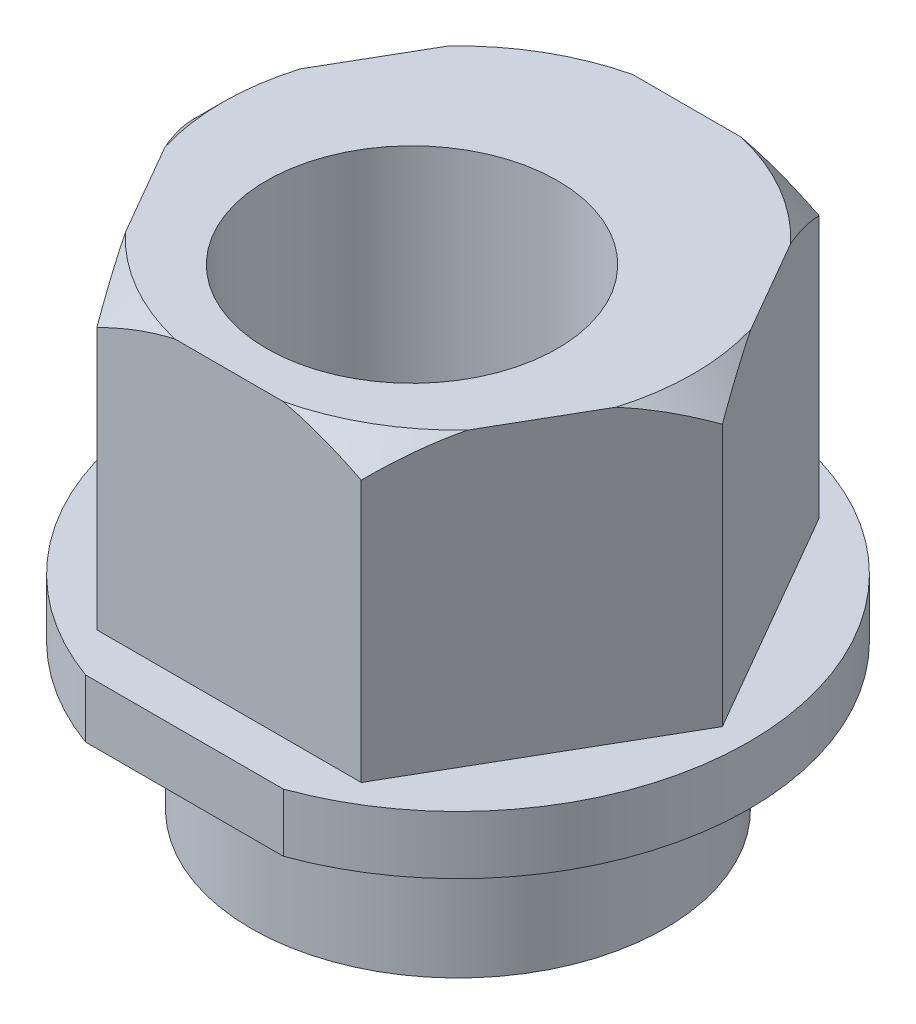
ISO-10303-21;
HEADER;
FILE_DESCRIPTION(('STEP AP214'),'2;1');
FILE_NAME('part.step','',(''),(''),'','','');
FILE_SCHEMA(('AUTOMOTIVE_DESIGN { 1 0 10303 214 1 1 1 1 }'));
ENDSEC;
DATA;
#1=APPLICATION_CONTEXT('core data for automotive mechanical design processes');
#2=APPLICATION_PROTOCOL_DEFINITION('international standard','automotive_design',2000,#1);
#3=PRODUCT_CONTEXT('',#1,'mechanical');
#4=PRODUCT('Part','Part','',(#3));
#5=PRODUCT_RELATED_PRODUCT_CATEGORY('part','',(#4));
#6=PRODUCT_DEFINITION_FORMATION('','',#4);
#7=PRODUCT_DEFINITION_CONTEXT('part definition',#1,'design');
#8=PRODUCT_DEFINITION('design','',#6,#7);
#9=PRODUCT_DEFINITION_SHAPE('','',#8);
#10=(LENGTH_UNIT() NAMED_UNIT(*) SI_UNIT(.MILLI.,.METRE.));
#11=(NAMED_UNIT(*) PLANE_ANGLE_UNIT() SI_UNIT($,.RADIAN.));
#12=(NAMED_UNIT(*) SI_UNIT($,.STERADIAN.) SOLID_ANGLE_UNIT());
#13=UNCERTAINTY_MEASURE_WITH_UNIT(LENGTH_MEASURE(1.E-05),#10,'distance_accuracy_value','');
#14=(GEOMETRIC_REPRESENTATION_CONTEXT(3) GLOBAL_UNCERTAINTY_ASSIGNED_CONTEXT((#13)) GLOBAL_UNIT_ASSIGNED_CONTEXT((#10,
#11,#12)) REPRESENTATION_CONTEXT('',''));
#15=CARTESIAN_POINT('',(0.,0.,0.));
#16=DIRECTION('',(0.,0.,1.));
#17=DIRECTION('',(1.,0.,0.));
#18=AXIS2_PLACEMENT_3D('',#15,#16,#17);
#19=CARTESIAN_POINT('',(0.,-1.,0.));
#20=DIRECTION('',(0.,1.,0.));
#21=DIRECTION('',(0.,0.,1.));
#22=AXIS2_PLACEMENT_3D('',#19,#20,#21);
#23=PLANE('',#22);
#24=CARTESIAN_POINT('',(0.,-1.,0.));
#25=DIRECTION('',(0.,1.,0.));
#26=DIRECTION('',(0.,0.,1.));
#27=AXIS2_PLACEMENT_3D('',#24,#25,#26);
#28=CIRCLE('',#27,5.);
#29=CARTESIAN_POINT('',(1.7,-1.,4.7021271782035));
#30=VERTEX_POINT('',#29);
#31=CARTESIAN_POINT('',(-1.7,-1.,4.7021271782035));
#32=VERTEX_POINT('',#31);
#33=EDGE_CURVE('E221',#30,#32,#28,.T.);
#34=ORIENTED_EDGE('',*,*,#33,.F.);
#35=DIRECTION('',(-1.,0.,0.));
#36=VECTOR('',#35,1.);
#37=CARTESIAN_POINT('',(0.,-1.,4.7021271782035));
#38=LINE('',#37,#36);
#39=EDGE_CURVE('E330',#30,#32,#38,.T.);
#40=ORIENTED_EDGE('',*,*,#39,.T.);
#41=EDGE_LOOP('',(#34,#40));
#42=FACE_BOUND('',#41,.T.);
#43=CARTESIAN_POINT('',(0.,-1.,0.));
#44=DIRECTION('',(0.,1.,0.));
#45=DIRECTION('',(0.,0.,1.));
#46=AXIS2_PLACEMENT_3D('',#43,#44,#45);
#47=CIRCLE('',#46,3.555);
#48=CARTESIAN_POINT('',(0.,-1.,3.555));
#49=VERTEX_POINT('',#48);
#50=EDGE_CURVE('E166',#49,#49,#47,.F.);
#51=ORIENTED_EDGE('',*,*,#50,.F.);
#52=EDGE_LOOP('',(#51));
#53=FACE_BOUND('',#52,.T.);
#54=ADVANCED_FACE('F34',(#42,#53),#23,.F.);
#55=CARTESIAN_POINT('',(2.27187330926118,5.,3.935));
#56=DIRECTION('',(-0.866025403784439,0.,-0.5));
#57=DIRECTION('',(-0.5,0.,0.866025403784439));
#58=AXIS2_PLACEMENT_3D('',#55,#56,#57);
#59=PLANE('',#58);
#60=DIRECTION('',(0.,-1.,0.));
#61=VECTOR('',#60,1.);
#62=CARTESIAN_POINT('',(4.54374661852235,5.,0.));
#63=LINE('',#62,#61);
#64=CARTESIAN_POINT('',(4.54374661852235,4.5,0.));
#65=VERTEX_POINT('',#64);
#66=CARTESIAN_POINT('',(4.54374661852235,0.,0.));
#67=VERTEX_POINT('',#66);
#68=EDGE_CURVE('E163',#65,#67,#63,.T.);
#69=ORIENTED_EDGE('',*,*,#68,.F.);
#70=CARTESIAN_POINT('',(6.12736327266163,2.33046829888115,-2.74290450468147));
#71=CARTESIAN_POINT('',(6.07348339276709,2.4177650828994,-2.64958181519841));
#72=CARTESIAN_POINT('',(6.01938921555573,2.50453762285222,-2.55588795187471));
#73=CARTESIAN_POINT('',(5.91069789973588,2.67683309661582,-2.36762907053321));
#74=CARTESIAN_POINT('',(5.85610071578471,2.76235591593962,-2.27306397397959));
#75=CARTESIAN_POINT('',(5.74620735938589,2.9321379387506,-2.08272309728255));
#76=CARTESIAN_POINT('',(5.6909098259844,3.01639362513631,-1.98694495989795));
#77=CARTESIAN_POINT('',(5.57966030231228,3.18315508159383,-1.79425513258));
#78=CARTESIAN_POINT('',(5.52370832991605,3.26566089928668,-1.69734347360602));
#79=CARTESIAN_POINT('',(5.40948255505868,3.43085092459455,-1.49949862801914));
#80=CARTESIAN_POINT('',(5.3511874452437,3.51347634106705,-1.3985285359868));
#81=CARTESIAN_POINT('',(5.23367321649109,3.67605365317037,-1.194987921175));
#82=CARTESIAN_POINT('',(5.17445413325307,3.75600565172091,-1.09241746022911));
#83=CARTESIAN_POINT('',(5.05499257757878,3.9125743398257,-0.885503976250002));
#84=CARTESIAN_POINT('',(4.99475102957391,3.98919384008597,-0.78116255437897));
#85=CARTESIAN_POINT('',(4.873034492307,4.1383918042904,-0.570343327711337));
#86=CARTESIAN_POINT('',(4.81155966257741,4.21097078637303,-0.463865799233039));
#87=CARTESIAN_POINT('',(4.68581480841085,4.35265115676022,-0.246069323026223));
#88=CARTESIAN_POINT('',(4.62151303943029,4.42164059850529,-0.134695392135335));
#89=CARTESIAN_POINT('',(4.4912183922476,4.55301635986169,0.090981556739347));
#90=CARTESIAN_POINT('',(4.42522527529575,4.61540174079966,0.205284988249787));
#91=CARTESIAN_POINT('',(4.29176890522431,4.73150823576122,0.436438201807242));
#92=CARTESIAN_POINT('',(4.22431561588303,4.78527468558276,0.553270726083977));
#93=CARTESIAN_POINT('',(4.08756303909753,4.88247623364584,0.790133137142428));
#94=CARTESIAN_POINT('',(4.01826431274338,4.92591443311341,0.910162052087628));
#95=CARTESIAN_POINT('',(3.89160680975576,4.99299560676046,1.129539282422));
#96=CARTESIAN_POINT('',(3.83454175212893,5.01884439579798,1.22837886156851));
#97=CARTESIAN_POINT('',(3.71955042243969,5.06126068823275,1.42754968702018));
#98=CARTESIAN_POINT('',(3.66162427680432,5.0778295405829,1.52788071434728));
#99=CARTESIAN_POINT('',(3.54536540774452,5.10083438466152,1.72924698238935));
#100=CARTESIAN_POINT('',(3.4870335640049,5.1072879053957,1.83028069944554));
#101=CARTESIAN_POINT('',(3.37031281221754,5.10976287991731,2.03244697183888));
#102=CARTESIAN_POINT('',(3.31192390350574,5.10578421082689,2.13357952832621));
#103=CARTESIAN_POINT('',(3.19571069696838,5.08764038060559,2.33486670655941));
#104=CARTESIAN_POINT('',(3.13788528988516,5.07350318473267,2.43502324959591));
#105=CARTESIAN_POINT('',(3.02300572590152,5.03579603444199,2.63400049116693));
#106=CARTESIAN_POINT('',(2.96595175572664,5.01222383709666,2.73282086628335));
#107=CARTESIAN_POINT('',(2.85271904802042,4.95661618256865,2.9289456691091));
#108=CARTESIAN_POINT('',(2.79654337792266,4.92455603960202,3.02624478386765));
#109=CARTESIAN_POINT('',(2.68537248742994,4.85318593152667,3.21879841452373));
#110=CARTESIAN_POINT('',(2.63037720983353,4.81387631861451,3.31405302949706));
#111=CARTESIAN_POINT('',(2.5019161833033,4.71383121159169,3.53655405423988));
#112=CARTESIAN_POINT('',(2.42896022795634,4.65048731772351,3.66291747561553));
#113=CARTESIAN_POINT('',(2.28511505424096,4.51496245516658,3.91206462491415));
#114=CARTESIAN_POINT('',(2.2142269607044,4.44277678394606,4.03484640457117));
#115=CARTESIAN_POINT('',(2.07416708594693,4.29140781010891,4.27743722375284));
#116=CARTESIAN_POINT('',(2.00499919286836,4.21221022636325,4.39723952881742));
#117=CARTESIAN_POINT('',(1.86828970424628,4.04847541244671,4.63402730898762));
#118=CARTESIAN_POINT('',(1.80074782327538,3.96393912900212,4.75101327846797));
#119=CARTESIAN_POINT('',(1.6667324101583,3.790255628053,4.9831347829841));
#120=CARTESIAN_POINT('',(1.60026513983173,3.70108917509827,5.09825947223014));
#121=CARTESIAN_POINT('',(1.46849790545969,3.51936003005431,5.32648701693534));
#122=CARTESIAN_POINT('',(1.40319803917282,3.42679705550268,5.43958970307165));
#123=CARTESIAN_POINT('',(1.27366225353528,3.23904020589262,5.66395226519422));
#124=CARTESIAN_POINT('',(1.20942525212282,3.14384930831284,5.77521401536649));
#125=CARTESIAN_POINT('',(1.08179181966025,2.9512386314917,5.99628160513605));
#126=CARTESIAN_POINT('',(1.01839540535985,2.85381880794148,6.10608741572204));
#127=CARTESIAN_POINT('',(0.910409016945997,2.6853578347565,6.2931253269807));
#128=CARTESIAN_POINT('',(0.865642352807006,2.61476846228915,6.3706634637548));
#129=CARTESIAN_POINT('',(0.776622094234247,2.47305833440251,6.52485107450574));
#130=CARTESIAN_POINT('',(0.732367142810404,2.40194099006958,6.60150289885833));
#131=CARTESIAN_POINT('',(0.688256655121896,2.33046829888115,6.67790450468147));
#132=B_SPLINE_CURVE_WITH_KNOTS('',3,(#70,#71,#72,#73,#74,#75,#76,#77,#78,#79,#80,#81,#82,#83,
#84,#85,#86,#87,#88,#89,#90,#91,#92,#93,#94,#95,#96,#97,#98,#99,#100,#101,#102,#103,#104,#105,
#106,#107,#108,#109,#110,#111,#112,#113,#114,#115,#116,#117,#118,#119,#120,#121,#122,#123,#124,
#125,#126,#127,#128,#129,#130,#131),.UNSPECIFIED.,.F.,.F.,(4,2,2,2,2,2,2,2,2,2,2,2,2,2,2,2,2,2,
2,2,2,2,2,2,2,2,2,2,2,2,4),(0.,0.416050988652375,0.832139855784054,1.24922530063749,
1.6662993802975,2.09496685038955,2.52361779884089,2.95189991005181,3.38012697311563,
3.81779500231414,4.25552515650994,4.69087140580247,5.12608676971888,5.4768138337239,
5.82748990199696,6.17755760407587,6.52762942952254,6.87674122143841,7.22593605499141,
7.5761578380004,7.92636261087879,8.40316579002672,8.88022366888807,9.35827656071276,
9.83624491486482,10.316388748245,10.7965726023688,11.2762330860941,11.7559031133002,
12.0979389750605,12.4385584137849),.UNSPECIFIED.);
#133=CARTESIAN_POINT('',(3.87355176865353,5.,1.1608115309438));
#134=VERTEX_POINT('',#133);
#135=EDGE_CURVE('E310',#65,#134,#132,.T.);
#136=ORIENTED_EDGE('',*,*,#135,.T.);
#137=DIRECTION('',(0.5,0.,-0.866025403784439));
#138=VECTOR('',#137,1.);
#139=CARTESIAN_POINT('',(2.27187330926118,5.,3.935));
#140=LINE('',#139,#138);
#141=CARTESIAN_POINT('',(2.94206815913,5.,2.7741884690562));
#142=VERTEX_POINT('',#141);
#143=EDGE_CURVE('E233',#142,#134,#140,.T.);
#144=ORIENTED_EDGE('',*,*,#143,.F.);
#145=CARTESIAN_POINT('',(2.27187330926118,4.5,3.935));
#146=VERTEX_POINT('',#145);
#147=EDGE_CURVE('E250',#142,#146,#132,.T.);
#148=ORIENTED_EDGE('',*,*,#147,.T.);
#149=DIRECTION('',(0.,-1.,0.));
#150=VECTOR('',#149,1.);
#151=CARTESIAN_POINT('',(2.27187330926118,5.,3.935));
#152=LINE('',#151,#150);
#153=CARTESIAN_POINT('',(2.27187330926118,0.,3.935));
#154=VERTEX_POINT('',#153);
#155=EDGE_CURVE('E217',#146,#154,#152,.T.);
#156=ORIENTED_EDGE('',*,*,#155,.T.);
#157=DIRECTION('',(0.5,0.,-0.866025403784439));
#158=VECTOR('',#157,1.);
#159=CARTESIAN_POINT('',(2.27187330926118,0.,3.935));
#160=LINE('',#159,#158);
#161=EDGE_CURVE('E218',#154,#67,#160,.T.);
#162=ORIENTED_EDGE('',*,*,#161,.T.);
#163=EDGE_LOOP('',(#69,#136,#144,#148,#156,#162));
#164=FACE_BOUND('',#163,.T.);
#165=ADVANCED_FACE('F36',(#164),#59,.F.);
#166=CARTESIAN_POINT('',(4.54374661852235,5.,0.));
#167=DIRECTION('',(-0.866025403784438,0.,0.5));
#168=DIRECTION('',(0.5,0.,0.866025403784438));
#169=AXIS2_PLACEMENT_3D('',#166,#167,#168);
#170=PLANE('',#169);
#171=DIRECTION('',(0.,-1.,0.));
#172=VECTOR('',#171,1.);
#173=CARTESIAN_POINT('',(2.27187330926118,5.,-3.935));
#174=LINE('',#173,#172);
#175=CARTESIAN_POINT('',(2.27187330926118,4.5,-3.935));
#176=VERTEX_POINT('',#175);
#177=CARTESIAN_POINT('',(2.27187330926118,0.,-3.935));
#178=VERTEX_POINT('',#177);
#179=EDGE_CURVE('E152',#176,#178,#174,.T.);
#180=ORIENTED_EDGE('',*,*,#179,.F.);
#181=CARTESIAN_POINT('',(0.688256655121894,2.33046829888116,-6.67790450468146));
#182=CARTESIAN_POINT('',(0.742136535016436,2.4177650828994,-6.58458181519841));
#183=CARTESIAN_POINT('',(0.796230712227795,2.50453762285222,-6.4908879518747));
#184=CARTESIAN_POINT('',(0.904922028047648,2.67683309661582,-6.3026290705332));
#185=CARTESIAN_POINT('',(0.959519211998818,2.76235591593963,-6.20806397397959));
#186=CARTESIAN_POINT('',(1.06941256839764,2.93213793875061,-6.01772309728255));
#187=CARTESIAN_POINT('',(1.12471010179913,3.01639362513632,-5.92194495989794));
#188=CARTESIAN_POINT('',(1.23595962547125,3.18315508159383,-5.72925513257999));
#189=CARTESIAN_POINT('',(1.29191159786749,3.26566089928668,-5.63234347360602));
#190=CARTESIAN_POINT('',(1.40613737272485,3.43085092459456,-5.43449862801913));
#191=CARTESIAN_POINT('',(1.46443248253983,3.51347634106706,-5.33352853598679));
#192=CARTESIAN_POINT('',(1.58194671129244,3.67605365317038,-5.12998792117499));
#193=CARTESIAN_POINT('',(1.64116579453046,3.75600565172092,-5.0274174602291));
#194=CARTESIAN_POINT('',(1.76062735020476,3.9125743398257,-4.82050397624999));
#195=CARTESIAN_POINT('',(1.82086889820963,3.98919384008598,-4.71616255437896));
#196=CARTESIAN_POINT('',(1.94258543547653,4.1383918042904,-4.50534332771133));
#197=CARTESIAN_POINT('',(2.00406026520612,4.21097078637303,-4.39886579923303));
#198=CARTESIAN_POINT('',(2.12980511937268,4.35265115676022,-4.18106932302621));
#199=CARTESIAN_POINT('',(2.19410688835324,4.4216405985053,-4.06969539213533));
#200=CARTESIAN_POINT('',(2.32440153553593,4.5530163598617,-3.84401844326064));
#201=CARTESIAN_POINT('',(2.39039465248778,4.61540174079966,-3.7297150117502));
#202=CARTESIAN_POINT('',(2.52385102255923,4.73150823576123,-3.49856179819275));
#203=CARTESIAN_POINT('',(2.5913043119005,4.78527468558276,-3.38172927391602));
#204=CARTESIAN_POINT('',(2.728056888686,4.88247623364584,-3.14486686285757));
#205=CARTESIAN_POINT('',(2.79735561504015,4.92591443311342,-3.02483794791237));
#206=CARTESIAN_POINT('',(2.92401311802778,4.99299560676046,-2.805460717578));
#207=CARTESIAN_POINT('',(2.98107817565461,5.01884439579799,-2.70662113843148));
#208=CARTESIAN_POINT('',(3.09606950534385,5.06126068823276,-2.50745031297981));
#209=CARTESIAN_POINT('',(3.15399565097922,5.0778295405829,-2.40711928565272));
#210=CARTESIAN_POINT('',(3.27025452003902,5.10083438466152,-2.20575301761065));
#211=CARTESIAN_POINT('',(3.32858636377864,5.1072879053957,-2.10471930055446));
#212=CARTESIAN_POINT('',(3.445307115566,5.10976287991731,-1.90255302816112));
#213=CARTESIAN_POINT('',(3.50369602427779,5.10578421082689,-1.80142047167379));
#214=CARTESIAN_POINT('',(3.61990923081515,5.08764038060559,-1.60013329344058));
#215=CARTESIAN_POINT('',(3.67773463789837,5.07350318473267,-1.49997675040409));
#216=CARTESIAN_POINT('',(3.79261420188202,5.03579603444199,-1.30099950883306));
#217=CARTESIAN_POINT('',(3.8496681720569,5.01222383709666,-1.20217913371665));
#218=CARTESIAN_POINT('',(3.96290087976311,4.95661618256865,-1.00605433089089));
#219=CARTESIAN_POINT('',(4.01907654986087,4.92455603960202,-0.908755216132345));
#220=CARTESIAN_POINT('',(4.13024744035359,4.85318593152667,-0.716201585476272));
#221=CARTESIAN_POINT('',(4.18524271795,4.81387631861451,-0.620946970502936));
#222=CARTESIAN_POINT('',(4.31370374448024,4.71383121159169,-0.398445945760117));
#223=CARTESIAN_POINT('',(4.38665969982719,4.6504873177235,-0.272082524384468));
#224=CARTESIAN_POINT('',(4.53050487354258,4.51496245516658,-0.0229353750858439));
#225=CARTESIAN_POINT('',(4.60139296707914,4.44277678394605,0.0998464045711766));
#226=CARTESIAN_POINT('',(4.74145284183661,4.2914078101089,0.342437223752842));
#227=CARTESIAN_POINT('',(4.81062073491518,4.21221022636324,0.462239528817422));
#228=CARTESIAN_POINT('',(4.94733022353726,4.0484754124467,0.699027308987622));
#229=CARTESIAN_POINT('',(5.01487210450815,3.96393912900211,0.81601327846798));
#230=CARTESIAN_POINT('',(5.14888751762524,3.79025562805299,1.04813478298411));
#231=CARTESIAN_POINT('',(5.21535478795181,3.70108917509827,1.16325947223014));
#232=CARTESIAN_POINT('',(5.34712202232385,3.5193600300543,1.39148701693534));
#233=CARTESIAN_POINT('',(5.41242188861072,3.42679705550267,1.50458970307166));
#234=CARTESIAN_POINT('',(5.54195767424825,3.23904020589262,1.72895226519422));
#235=CARTESIAN_POINT('',(5.60619467566072,3.14384930831283,1.84021401536649));
#236=CARTESIAN_POINT('',(5.73382810812329,2.95123863149169,2.06128160513606));
#237=CARTESIAN_POINT('',(5.79722452242369,2.85381880794147,2.17108741572204));
#238=CARTESIAN_POINT('',(5.90521091083754,2.68535783475649,2.3581253269807));
#239=CARTESIAN_POINT('',(5.94997757497653,2.61476846228915,2.43566346375481));
#240=CARTESIAN_POINT('',(6.03899783354929,2.47305833440251,2.58985107450574));
#241=CARTESIAN_POINT('',(6.08325278497313,2.40194099006958,2.66650289885833));
#242=CARTESIAN_POINT('',(6.12736327266164,2.33046829888115,2.74290450468146));
#243=B_SPLINE_CURVE_WITH_KNOTS('',3,(#181,#182,#183,#184,#185,#186,#187,#188,#189,#190,#191,
#192,#193,#194,#195,#196,#197,#198,#199,#200,#201,#202,#203,#204,#205,#206,#207,#208,#209,#210,
#211,#212,#213,#214,#215,#216,#217,#218,#219,#220,#221,#222,#223,#224,#225,#226,#227,#228,#229,
#230,#231,#232,#233,#234,#235,#236,#237,#238,#239,#240,#241,#242),.UNSPECIFIED.,.F.,.F.,(4,2,2,
2,2,2,2,2,2,2,2,2,2,2,2,2,2,2,2,2,2,2,2,2,2,2,2,2,2,2,4),(0.,0.416050988652376,
0.832139855784055,1.24922530063749,1.66629938029751,2.09496685038956,2.5236177988409,
2.95189991005182,3.38012697311563,3.81779500231415,4.25552515650994,4.69087140580247,
5.12608676971889,5.4768138337239,5.82748990199696,6.17755760407587,6.52762942952254,
6.87674122143841,7.22593605499141,7.57615783800039,7.92636261087879,8.40316579002672,
8.88022366888807,9.35827656071276,9.83624491486482,10.316388748245,10.7965726023688,
11.2762330860941,11.7559031133002,12.0979389750605,12.4385584137849),.UNSPECIFIED.);
#244=CARTESIAN_POINT('',(2.94206815913,5.,-2.7741884690562));
#245=VERTEX_POINT('',#244);
#246=EDGE_CURVE('E135',#176,#245,#243,.T.);
#247=ORIENTED_EDGE('',*,*,#246,.T.);
#248=DIRECTION('',(-0.5,0.,-0.866025403784438));
#249=VECTOR('',#248,1.);
#250=CARTESIAN_POINT('',(4.54374661852235,5.,0.));
#251=LINE('',#250,#249);
#252=CARTESIAN_POINT('',(3.87355176865353,5.,-1.1608115309438));
#253=VERTEX_POINT('',#252);
#254=EDGE_CURVE('E211',#253,#245,#251,.T.);
#255=ORIENTED_EDGE('',*,*,#254,.F.);
#256=EDGE_CURVE('E145',#253,#65,#243,.T.);
#257=ORIENTED_EDGE('',*,*,#256,.T.);
#258=ORIENTED_EDGE('',*,*,#68,.T.);
#259=DIRECTION('',(-0.5,0.,-0.866025403784438));
#260=VECTOR('',#259,1.);
#261=CARTESIAN_POINT('',(4.54374661852235,0.,0.));
#262=LINE('',#261,#260);
#263=EDGE_CURVE('E162',#67,#178,#262,.T.);
#264=ORIENTED_EDGE('',*,*,#263,.T.);
#265=EDGE_LOOP('',(#180,#247,#255,#257,#258,#264));
#266=FACE_BOUND('',#265,.T.);
#267=ADVANCED_FACE('F160',(#266),#170,.F.);
#268=CARTESIAN_POINT('',(2.27187330926118,5.,-3.935));
#269=DIRECTION('',(0.,0.,1.));
#270=DIRECTION('',(1.,0.,0.));
#271=AXIS2_PLACEMENT_3D('',#268,#269,#270);
#272=PLANE('',#271);
#273=DIRECTION('',(0.,-1.,0.));
#274=VECTOR('',#273,1.);
#275=CARTESIAN_POINT('',(-2.27187330926118,5.,-3.935));
#276=LINE('',#275,#274);
#277=CARTESIAN_POINT('',(-2.27187330926118,4.5,-3.935));
#278=VERTEX_POINT('',#277);
#279=CARTESIAN_POINT('',(-2.27187330926118,0.,-3.935));
#280=VERTEX_POINT('',#279);
#281=EDGE_CURVE('E164',#278,#280,#276,.T.);
#282=ORIENTED_EDGE('',*,*,#281,.F.);
#283=CARTESIAN_POINT('',(-5.01477781394264,2.6694057488158,-3.935));
#284=CARTESIAN_POINT('',(-4.90228240032233,2.75789162999437,-3.935));
#285=CARTESIAN_POINT('',(-4.78924605492269,2.84569863662638,-3.935));
#286=CARTESIAN_POINT('',(-4.56188241632701,3.01966288534844,-3.935));
#287=CARTESIAN_POINT('',(-4.44755491307628,3.10581985266844,-3.935));
#288=CARTESIAN_POINT('',(-4.21685222046402,3.27659538663721,-3.935));
#289=CARTESIAN_POINT('',(-4.10046957789372,3.36120391114583,-3.935));
#290=CARTESIAN_POINT('',(-3.86599418351296,3.52801066974508,-3.935));
#291=CARTESIAN_POINT('',(-3.74790151420127,3.61020901953759,-3.935));
#292=CARTESIAN_POINT('',(-3.50380543280417,3.77568927594522,-3.935));
#293=CARTESIAN_POINT('',(-3.3777005297054,3.85882204730453,-3.935));
#294=CARTESIAN_POINT('',(-3.12293409141574,4.0210686075328,-3.935));
#295=CARTESIAN_POINT('',(-2.99427277147477,4.10018273279293,-3.935));
#296=CARTESIAN_POINT('',(-2.7342134500717,4.25322326602883,-3.935));
#297=CARTESIAN_POINT('',(-2.60282112402671,4.32715926211431,-3.935));
#298=CARTESIAN_POINT('',(-2.33665993470769,4.46865096658867,-3.935));
#299=CARTESIAN_POINT('',(-2.20189200633557,4.53620841737975,-3.935));
#300=CARTESIAN_POINT('',(-1.94277039794665,4.65662539379787,-3.935));
#301=CARTESIAN_POINT('',(-1.81879024517606,4.7102827638368,-3.935));
#302=CARTESIAN_POINT('',(-1.56760322182998,4.80956431437058,-3.935));
#303=CARTESIAN_POINT('',(-1.4403960426367,4.8551877231961,-3.935));
#304=CARTESIAN_POINT('',(-1.18430895439847,4.93616339546024,-3.935));
#305=CARTESIAN_POINT('',(-1.05546474171029,4.97162701315895,-3.935));
#306=CARTESIAN_POINT('',(-0.795188728182397,5.03120060018271,-3.935));
#307=CARTESIAN_POINT('',(-0.663757985336443,5.05531511515621,-3.935));
#308=CARTESIAN_POINT('',(-0.39667530812576,5.09105643721047,-3.935));
#309=CARTESIAN_POINT('',(-0.260990364554486,5.10244193256667,-3.935));
#310=CARTESIAN_POINT('',(0.0108256286758382,5.11107629854814,-3.935));
#311=CARTESIAN_POINT('',(0.146956639108313,5.10832638056083,-3.935));
#312=CARTESIAN_POINT('',(0.418619878870053,5.08887050209526,-3.935));
#313=CARTESIAN_POINT('',(0.554148970208934,5.0721215602934,-3.935));
#314=CARTESIAN_POINT('',(0.822982454746628,5.02579152850102,-3.935));
#315=CARTESIAN_POINT('',(0.956286242224141,4.99620700199297,-3.935));
#316=CARTESIAN_POINT('',(1.26105655280132,4.91498323631563,-3.935));
#317=CARTESIAN_POINT('',(1.43144793684183,4.85934235740488,-3.935));
#318=CARTESIAN_POINT('',(1.76659971199313,4.73318715507506,-3.935));
#319=CARTESIAN_POINT('',(1.93135663408204,4.66266385383244,-3.935));
#320=CARTESIAN_POINT('',(2.25670464302017,4.50985567629177,-3.935));
#321=CARTESIAN_POINT('',(2.41725700907644,4.42748946751823,-3.935));
#322=CARTESIAN_POINT('',(2.7335996666453,4.25424890954647,-3.935));
#323=CARTESIAN_POINT('',(2.88939106725242,4.16337656225559,-3.935));
#324=CARTESIAN_POINT('',(3.2171018287942,3.96289685347115,-3.935));
#325=CARTESIAN_POINT('',(3.38846902004868,3.85239290462363,-3.935));
#326=CARTESIAN_POINT('',(3.7271209143155,3.62526903861077,-3.935));
#327=CARTESIAN_POINT('',(3.89440474117752,3.50864782550207,-3.935));
#328=CARTESIAN_POINT('',(4.22200861608271,3.27340163426143,-3.935));
#329=CARTESIAN_POINT('',(4.38240091884256,3.15487687320021,-3.935));
#330=CARTESIAN_POINT('',(4.6209837589724,2.97456068361506,-3.935));
#331=CARTESIAN_POINT('',(4.70015123515769,2.91405422097405,-3.935));
#332=CARTESIAN_POINT('',(4.85789331048121,2.79227931530866,-3.935));
#333=CARTESIAN_POINT('',(4.93646793238964,2.73101090179094,-3.935));
#334=CARTESIAN_POINT('',(5.01477781394264,2.6694057488158,-3.935));
#335=B_SPLINE_CURVE_WITH_KNOTS('',3,(#283,#284,#285,#286,#287,#288,#289,#290,#291,#292,#293,
#294,#295,#296,#297,#298,#299,#300,#301,#302,#303,#304,#305,#306,#307,#308,#309,#310,#311,#312,
#313,#314,#315,#316,#317,#318,#319,#320,#321,#322,#323,#324,#325,#326,#327,#328,#329,#330,#331,
#332,#333,#334),.UNSPECIFIED.,.F.,.F.,(4,2,2,2,2,2,2,2,2,2,2,2,2,2,2,2,2,2,2,2,2,2,2,2,2,4),(0.,
0.429382623340998,0.858836137877717,1.29047192805164,1.72208696325132,2.17515026344406,
2.62817557609088,3.08033856015113,3.53237766908385,3.9374314291705,4.34252407384557,
4.74299021725164,5.14329582542998,5.55106798246257,5.95880519450876,6.36779890408527,
6.77690218266532,7.31369645202257,7.85081547305105,8.39181700182992,8.932691525285,
9.54423171138721,10.15590197977,10.7541421331558,11.0530644250241,11.35197517691),.UNSPECIFIED.);
#336=CARTESIAN_POINT('',(-0.931483609523527,5.,-3.935));
#337=VERTEX_POINT('',#336);
#338=EDGE_CURVE('E157',#278,#337,#335,.T.);
#339=ORIENTED_EDGE('',*,*,#338,.T.);
#340=DIRECTION('',(-1.,0.,0.));
#341=VECTOR('',#340,1.);
#342=CARTESIAN_POINT('',(2.27187330926118,5.,-3.935));
#343=LINE('',#342,#341);
#344=CARTESIAN_POINT('',(0.931483609523526,5.,-3.935));
#345=VERTEX_POINT('',#344);
#346=EDGE_CURVE('E156',#345,#337,#343,.T.);
#347=ORIENTED_EDGE('',*,*,#346,.F.);
#348=EDGE_CURVE('E138',#345,#176,#335,.T.);
#349=ORIENTED_EDGE('',*,*,#348,.T.);
#350=ORIENTED_EDGE('',*,*,#179,.T.);
#351=DIRECTION('',(-1.,0.,0.));
#352=VECTOR('',#351,1.);
#353=CARTESIAN_POINT('',(2.27187330926118,0.,-3.935));
#354=LINE('',#353,#352);
#355=EDGE_CURVE('E223',#178,#280,#354,.T.);
#356=ORIENTED_EDGE('',*,*,#355,.T.);
#357=EDGE_LOOP('',(#282,#339,#347,#349,#350,#356));
#358=FACE_BOUND('',#357,.T.);
#359=ADVANCED_FACE('F150',(#358),#272,.F.);
#360=CARTESIAN_POINT('',(-2.27187330926118,5.,-3.935));
#361=DIRECTION('',(0.866025403784438,0.,0.5));
#362=DIRECTION('',(0.5,0.,-0.866025403784439));
#363=AXIS2_PLACEMENT_3D('',#360,#361,#362);
#364=PLANE('',#363);
#365=DIRECTION('',(0.,-1.,0.));
#366=VECTOR('',#365,1.);
#367=CARTESIAN_POINT('',(-4.54374661852235,5.,0.));
#368=LINE('',#367,#366);
#369=CARTESIAN_POINT('',(-4.54374661852235,4.5,0.));
#370=VERTEX_POINT('',#369);
#371=CARTESIAN_POINT('',(-4.54374661852235,0.,0.));
#372=VERTEX_POINT('',#371);
#373=EDGE_CURVE('E168',#370,#372,#368,.T.);
#374=ORIENTED_EDGE('',*,*,#373,.F.);
#375=CARTESIAN_POINT('',(-6.12736327266164,2.33046829888115,2.74290450468147));
#376=CARTESIAN_POINT('',(-6.07348339276709,2.4177650828994,2.64958181519841));
#377=CARTESIAN_POINT('',(-6.01938921555574,2.50453762285222,2.5558879518747));
#378=CARTESIAN_POINT('',(-5.91069789973588,2.67683309661582,2.3676290705332));
#379=CARTESIAN_POINT('',(-5.85610071578471,2.76235591593963,2.27306397397959));
#380=CARTESIAN_POINT('',(-5.74620735938589,2.9321379387506,2.08272309728255));
#381=CARTESIAN_POINT('',(-5.6909098259844,3.01639362513631,1.98694495989795));
#382=CARTESIAN_POINT('',(-5.57966030231228,3.18315508159383,1.79425513257999));
#383=CARTESIAN_POINT('',(-5.52370832991604,3.26566089928668,1.69734347360602));
#384=CARTESIAN_POINT('',(-5.40948255505868,3.43085092459455,1.49949862801913));
#385=CARTESIAN_POINT('',(-5.3511874452437,3.51347634106705,1.39852853598679));
#386=CARTESIAN_POINT('',(-5.23367321649109,3.67605365317037,1.19498792117499));
#387=CARTESIAN_POINT('',(-5.17445413325307,3.75600565172092,1.0924174602291));
#388=CARTESIAN_POINT('',(-5.05499257757878,3.9125743398257,0.885503976249998));
#389=CARTESIAN_POINT('',(-4.99475102957391,3.98919384008598,0.781162554378965));
#390=CARTESIAN_POINT('',(-4.873034492307,4.1383918042904,0.570343327711332));
#391=CARTESIAN_POINT('',(-4.81155966257741,4.21097078637303,0.463865799233036));
#392=CARTESIAN_POINT('',(-4.68581480841085,4.35265115676022,0.24606932302622));
#393=CARTESIAN_POINT('',(-4.62151303943029,4.42164059850529,0.134695392135332));
#394=CARTESIAN_POINT('',(-4.4912183922476,4.55301635986169,-0.0909815567393509));
#395=CARTESIAN_POINT('',(-4.42522527529575,4.61540174079966,-0.205284988249791));
#396=CARTESIAN_POINT('',(-4.2917689052243,4.73150823576122,-0.436438201807246));
#397=CARTESIAN_POINT('',(-4.22431561588303,4.78527468558276,-0.553270726083981));
#398=CARTESIAN_POINT('',(-4.08756303909753,4.88247623364584,-0.790133137142432));
#399=CARTESIAN_POINT('',(-4.01826431274338,4.92591443311341,-0.910162052087631));
#400=CARTESIAN_POINT('',(-3.89160680975576,4.99299560676046,-1.129539282422));
#401=CARTESIAN_POINT('',(-3.83454175212893,5.01884439579798,-1.22837886156851));
#402=CARTESIAN_POINT('',(-3.71955042243968,5.06126068823275,-1.42754968702018));
#403=CARTESIAN_POINT('',(-3.66162427680432,5.0778295405829,-1.52788071434728));
#404=CARTESIAN_POINT('',(-3.54536540774451,5.10083438466152,-1.72924698238935));
#405=CARTESIAN_POINT('',(-3.48703356400489,5.1072879053957,-1.83028069944554));
#406=CARTESIAN_POINT('',(-3.37031281221754,5.10976287991731,-2.03244697183888));
#407=CARTESIAN_POINT('',(-3.31192390350574,5.10578421082689,-2.13357952832621));
#408=CARTESIAN_POINT('',(-3.19571069696838,5.08764038060559,-2.33486670655941));
#409=CARTESIAN_POINT('',(-3.13788528988516,5.07350318473267,-2.43502324959591));
#410=CARTESIAN_POINT('',(-3.02300572590152,5.03579603444199,-2.63400049116693));
#411=CARTESIAN_POINT('',(-2.96595175572664,5.01222383709666,-2.73282086628335));
#412=CARTESIAN_POINT('',(-2.85271904802042,4.95661618256865,-2.9289456691091));
#413=CARTESIAN_POINT('',(-2.79654337792266,4.92455603960202,-3.02624478386765));
#414=CARTESIAN_POINT('',(-2.68537248742994,4.85318593152667,-3.21879841452372));
#415=CARTESIAN_POINT('',(-2.63037720983353,4.81387631861451,-3.31405302949706));
#416=CARTESIAN_POINT('',(-2.5019161833033,4.71383121159169,-3.53655405423988));
#417=CARTESIAN_POINT('',(-2.42896022795634,4.65048731772351,-3.66291747561553));
#418=CARTESIAN_POINT('',(-2.28511505424096,4.51496245516658,-3.91206462491415));
#419=CARTESIAN_POINT('',(-2.21422696070439,4.44277678394606,-4.03484640457117));
#420=CARTESIAN_POINT('',(-2.07416708594693,4.29140781010891,-4.27743722375283));
#421=CARTESIAN_POINT('',(-2.00499919286836,4.21221022636325,-4.39723952881741));
#422=CARTESIAN_POINT('',(-1.86828970424628,4.04847541244671,-4.63402730898761));
#423=CARTESIAN_POINT('',(-1.80074782327538,3.96393912900212,-4.75101327846797));
#424=CARTESIAN_POINT('',(-1.6667324101583,3.790255628053,-4.9831347829841));
#425=CARTESIAN_POINT('',(-1.60026513983173,3.70108917509828,-5.09825947223013));
#426=CARTESIAN_POINT('',(-1.46849790545969,3.51936003005432,-5.32648701693533));
#427=CARTESIAN_POINT('',(-1.40319803917282,3.42679705550269,-5.43958970307165));
#428=CARTESIAN_POINT('',(-1.27366225353529,3.23904020589263,-5.66395226519421));
#429=CARTESIAN_POINT('',(-1.20942525212282,3.14384930831284,-5.77521401536648));
#430=CARTESIAN_POINT('',(-1.08179181966026,2.95123863149171,-5.99628160513604));
#431=CARTESIAN_POINT('',(-1.01839540535985,2.85381880794148,-6.10608741572203));
#432=CARTESIAN_POINT('',(-0.910409016945998,2.68535783475651,-6.29312532698069));
#433=CARTESIAN_POINT('',(-0.865642352807006,2.61476846228916,-6.3706634637548));
#434=CARTESIAN_POINT('',(-0.776622094234247,2.47305833440251,-6.52485107450573));
#435=CARTESIAN_POINT('',(-0.732367142810403,2.40194099006959,-6.60150289885832));
#436=CARTESIAN_POINT('',(-0.688256655121894,2.33046829888116,-6.67790450468146));
#437=B_SPLINE_CURVE_WITH_KNOTS('',3,(#375,#376,#377,#378,#379,#380,#381,#382,#383,#384,#385,
#386,#387,#388,#389,#390,#391,#392,#393,#394,#395,#396,#397,#398,#399,#400,#401,#402,#403,#404,
#405,#406,#407,#408,#409,#410,#411,#412,#413,#414,#415,#416,#417,#418,#419,#420,#421,#422,#423,
#424,#425,#426,#427,#428,#429,#430,#431,#432,#433,#434,#435,#436),.UNSPECIFIED.,.F.,.F.,(4,2,2,
2,2,2,2,2,2,2,2,2,2,2,2,2,2,2,2,2,2,2,2,2,2,2,2,2,2,2,4),(0.,0.416050988652376,
0.832139855784055,1.24922530063749,1.66629938029751,2.09496685038956,2.5236177988409,
2.95189991005181,3.38012697311563,3.81779500231415,4.25552515650994,4.69087140580247,
5.12608676971889,5.4768138337239,5.82748990199696,6.17755760407587,6.52762942952254,
6.87674122143841,7.22593605499141,7.57615783800039,7.92636261087879,8.40316579002672,
8.88022366888806,9.35827656071275,9.83624491486481,10.316388748245,10.7965726023688,
11.276233086094,11.7559031133002,12.0979389750605,12.4385584137849),.UNSPECIFIED.);
#438=CARTESIAN_POINT('',(-3.87355176865353,5.,-1.1608115309438));
#439=VERTEX_POINT('',#438);
#440=EDGE_CURVE('E191',#370,#439,#437,.T.);
#441=ORIENTED_EDGE('',*,*,#440,.T.);
#442=DIRECTION('',(-0.5,0.,0.866025403784439));
#443=VECTOR('',#442,1.);
#444=CARTESIAN_POINT('',(-2.27187330926118,5.,-3.935));
#445=LINE('',#444,#443);
#446=CARTESIAN_POINT('',(-2.94206815913,5.,-2.7741884690562));
#447=VERTEX_POINT('',#446);
#448=EDGE_CURVE('E201',#447,#439,#445,.T.);
#449=ORIENTED_EDGE('',*,*,#448,.F.);
#450=EDGE_CURVE('E203',#447,#278,#437,.T.);
#451=ORIENTED_EDGE('',*,*,#450,.T.);
#452=ORIENTED_EDGE('',*,*,#281,.T.);
#453=DIRECTION('',(-0.5,0.,0.866025403784439));
#454=VECTOR('',#453,1.);
#455=CARTESIAN_POINT('',(-2.27187330926118,0.,-3.935));
#456=LINE('',#455,#454);
#457=EDGE_CURVE('E225',#280,#372,#456,.T.);
#458=ORIENTED_EDGE('',*,*,#457,.T.);
#459=EDGE_LOOP('',(#374,#441,#449,#451,#452,#458));
#460=FACE_BOUND('',#459,.T.);
#461=ADVANCED_FACE('F199',(#460),#364,.F.);
#462=CARTESIAN_POINT('',(-4.54374661852235,5.,0.));
#463=DIRECTION('',(0.866025403784438,0.,-0.5));
#464=DIRECTION('',(-0.5,0.,-0.866025403784439));
#465=AXIS2_PLACEMENT_3D('',#462,#463,#464);
#466=PLANE('',#465);
#467=DIRECTION('',(0.,-1.,0.));
#468=VECTOR('',#467,1.);
#469=CARTESIAN_POINT('',(-2.27187330926118,5.,3.935));
#470=LINE('',#469,#468);
#471=CARTESIAN_POINT('',(-2.27187330926118,4.5,3.935));
#472=VERTEX_POINT('',#471);
#473=CARTESIAN_POINT('',(-2.27187330926118,0.,3.935));
#474=VERTEX_POINT('',#473);
#475=EDGE_CURVE('E235',#472,#474,#470,.T.);
#476=ORIENTED_EDGE('',*,*,#475,.F.);
#477=CARTESIAN_POINT('',(-0.688256655121893,2.33046829888115,6.67790450468147));
#478=CARTESIAN_POINT('',(-0.742136535016436,2.4177650828994,6.58458181519841));
#479=CARTESIAN_POINT('',(-0.796230712227795,2.50453762285222,6.4908879518747));
#480=CARTESIAN_POINT('',(-0.904922028047647,2.67683309661582,6.3026290705332));
#481=CARTESIAN_POINT('',(-0.959519211998818,2.76235591593963,6.20806397397959));
#482=CARTESIAN_POINT('',(-1.06941256839764,2.9321379387506,6.01772309728255));
#483=CARTESIAN_POINT('',(-1.12471010179913,3.01639362513631,5.92194495989795));
#484=CARTESIAN_POINT('',(-1.23595962547125,3.18315508159383,5.72925513257999));
#485=CARTESIAN_POINT('',(-1.29191159786748,3.26566089928668,5.63234347360602));
#486=CARTESIAN_POINT('',(-1.40613737272485,3.43085092459455,5.43449862801913));
#487=CARTESIAN_POINT('',(-1.46443248253983,3.51347634106705,5.33352853598679));
#488=CARTESIAN_POINT('',(-1.58194671129244,3.67605365317037,5.12998792117499));
#489=CARTESIAN_POINT('',(-1.64116579453046,3.75600565172092,5.0274174602291));
#490=CARTESIAN_POINT('',(-1.76062735020475,3.9125743398257,4.82050397625));
#491=CARTESIAN_POINT('',(-1.82086889820962,3.98919384008598,4.71616255437897));
#492=CARTESIAN_POINT('',(-1.94258543547653,4.1383918042904,4.50534332771133));
#493=CARTESIAN_POINT('',(-2.00406026520612,4.21097078637303,4.39886579923304));
#494=CARTESIAN_POINT('',(-2.12980511937268,4.35265115676022,4.18106932302622));
#495=CARTESIAN_POINT('',(-2.19410688835324,4.42164059850529,4.06969539213533));
#496=CARTESIAN_POINT('',(-2.32440153553593,4.55301635986169,3.84401844326065));
#497=CARTESIAN_POINT('',(-2.39039465248778,4.61540174079966,3.72971501175021));
#498=CARTESIAN_POINT('',(-2.52385102255923,4.73150823576122,3.49856179819275));
#499=CARTESIAN_POINT('',(-2.5913043119005,4.78527468558276,3.38172927391602));
#500=CARTESIAN_POINT('',(-2.728056888686,4.88247623364584,3.14486686285757));
#501=CARTESIAN_POINT('',(-2.79735561504015,4.92591443311341,3.02483794791237));
#502=CARTESIAN_POINT('',(-2.92401311802777,4.99299560676046,2.805460717578));
#503=CARTESIAN_POINT('',(-2.9810781756546,5.01884439579798,2.70662113843149));
#504=CARTESIAN_POINT('',(-3.09606950534385,5.06126068823275,2.50745031297982));
#505=CARTESIAN_POINT('',(-3.15399565097921,5.0778295405829,2.40711928565272));
#506=CARTESIAN_POINT('',(-3.27025452003902,5.10083438466152,2.20575301761065));
#507=CARTESIAN_POINT('',(-3.32858636377864,5.1072879053957,2.10471930055446));
#508=CARTESIAN_POINT('',(-3.44530711556599,5.10976287991731,1.90255302816112));
#509=CARTESIAN_POINT('',(-3.50369602427779,5.10578421082689,1.80142047167379));
#510=CARTESIAN_POINT('',(-3.61990923081515,5.08764038060559,1.60013329344058));
#511=CARTESIAN_POINT('',(-3.67773463789837,5.07350318473267,1.49997675040409));
#512=CARTESIAN_POINT('',(-3.79261420188201,5.03579603444199,1.30099950883306));
#513=CARTESIAN_POINT('',(-3.84966817205689,5.01222383709666,1.20217913371665));
#514=CARTESIAN_POINT('',(-3.96290087976311,4.95661618256865,1.0060543308909));
#515=CARTESIAN_POINT('',(-4.01907654986087,4.92455603960202,0.908755216132348));
#516=CARTESIAN_POINT('',(-4.13024744035359,4.85318593152667,0.716201585476275));
#517=CARTESIAN_POINT('',(-4.18524271795,4.81387631861451,0.620946970502938));
#518=CARTESIAN_POINT('',(-4.31370374448024,4.71383121159169,0.39844594576012));
#519=CARTESIAN_POINT('',(-4.38665969982719,4.65048731772351,0.272082524384471));
#520=CARTESIAN_POINT('',(-4.53050487354258,4.51496245516658,0.0229353750858478));
#521=CARTESIAN_POINT('',(-4.60139296707914,4.44277678394605,-0.0998464045711718));
#522=CARTESIAN_POINT('',(-4.7414528418366,4.2914078101089,-0.342437223752836));
#523=CARTESIAN_POINT('',(-4.81062073491518,4.21221022636325,-0.462239528817416));
#524=CARTESIAN_POINT('',(-4.94733022353725,4.04847541244671,-0.699027308987616));
#525=CARTESIAN_POINT('',(-5.01487210450815,3.96393912900212,-0.816013278467974));
#526=CARTESIAN_POINT('',(-5.14888751762524,3.790255628053,-1.0481347829841));
#527=CARTESIAN_POINT('',(-5.21535478795181,3.70108917509827,-1.16325947223014));
#528=CARTESIAN_POINT('',(-5.34712202232384,3.51936003005431,-1.39148701693534));
#529=CARTESIAN_POINT('',(-5.41242188861071,3.42679705550268,-1.50458970307165));
#530=CARTESIAN_POINT('',(-5.54195767424825,3.23904020589263,-1.72895226519421));
#531=CARTESIAN_POINT('',(-5.60619467566072,3.14384930831284,-1.84021401536648));
#532=CARTESIAN_POINT('',(-5.73382810812328,2.9512386314917,-2.06128160513605));
#533=CARTESIAN_POINT('',(-5.79722452242368,2.85381880794148,-2.17108741572204));
#534=CARTESIAN_POINT('',(-5.90521091083754,2.6853578347565,-2.3581253269807));
#535=CARTESIAN_POINT('',(-5.94997757497653,2.61476846228915,-2.4356634637548));
#536=CARTESIAN_POINT('',(-6.03899783354928,2.47305833440251,-2.58985107450574));
#537=CARTESIAN_POINT('',(-6.08325278497313,2.40194099006958,-2.66650289885833));
#538=CARTESIAN_POINT('',(-6.12736327266164,2.33046829888115,-2.74290450468146));
#539=B_SPLINE_CURVE_WITH_KNOTS('',3,(#477,#478,#479,#480,#481,#482,#483,#484,#485,#486,#487,
#488,#489,#490,#491,#492,#493,#494,#495,#496,#497,#498,#499,#500,#501,#502,#503,#504,#505,#506,
#507,#508,#509,#510,#511,#512,#513,#514,#515,#516,#517,#518,#519,#520,#521,#522,#523,#524,#525,
#526,#527,#528,#529,#530,#531,#532,#533,#534,#535,#536,#537,#538),.UNSPECIFIED.,.F.,.F.,(4,2,2,
2,2,2,2,2,2,2,2,2,2,2,2,2,2,2,2,2,2,2,2,2,2,2,2,2,2,2,4),(0.,0.416050988652376,
0.832139855784055,1.24922530063749,1.66629938029751,2.09496685038956,2.5236177988409,
2.95189991005181,3.38012697311563,3.81779500231415,4.25552515650994,4.69087140580247,
5.12608676971889,5.4768138337239,5.82748990199696,6.17755760407587,6.52762942952254,
6.87674122143841,7.22593605499141,7.5761578380004,7.92636261087879,8.40316579002672,
8.88022366888807,9.35827656071275,9.83624491486482,10.316388748245,10.7965726023688,
11.2762330860941,11.7559031133002,12.0979389750605,12.4385584137849),.UNSPECIFIED.);
#540=CARTESIAN_POINT('',(-2.94206815913,5.,2.7741884690562));
#541=VERTEX_POINT('',#540);
#542=EDGE_CURVE('E256',#472,#541,#539,.T.);
#543=ORIENTED_EDGE('',*,*,#542,.T.);
#544=DIRECTION('',(0.5,0.,0.866025403784439));
#545=VECTOR('',#544,1.);
#546=CARTESIAN_POINT('',(-4.54374661852235,5.,0.));
#547=LINE('',#546,#545);
#548=CARTESIAN_POINT('',(-3.87355176865353,5.,1.16081153094381));
#549=VERTEX_POINT('',#548);
#550=EDGE_CURVE('E207',#549,#541,#547,.T.);
#551=ORIENTED_EDGE('',*,*,#550,.F.);
#552=EDGE_CURVE('E58',#549,#370,#539,.T.);
#553=ORIENTED_EDGE('',*,*,#552,.T.);
#554=ORIENTED_EDGE('',*,*,#373,.T.);
#555=DIRECTION('',(0.5,0.,0.866025403784439));
#556=VECTOR('',#555,1.);
#557=CARTESIAN_POINT('',(-4.54374661852235,0.,0.));
#558=LINE('',#557,#556);
#559=EDGE_CURVE('E227',#372,#474,#558,.T.);
#560=ORIENTED_EDGE('',*,*,#559,.T.);
#561=EDGE_LOOP('',(#476,#543,#551,#553,#554,#560));
#562=FACE_BOUND('',#561,.T.);
#563=ADVANCED_FACE('F239',(#562),#466,.F.);
#564=CARTESIAN_POINT('',(-2.27187330926118,5.,3.935));
#565=DIRECTION('',(0.,0.,-1.));
#566=DIRECTION('',(-1.,0.,0.));
#567=AXIS2_PLACEMENT_3D('',#564,#565,#566);
#568=PLANE('',#567);
#569=ORIENTED_EDGE('',*,*,#155,.F.);
#570=CARTESIAN_POINT('',(5.01477781394264,2.6694057488158,3.935));
#571=CARTESIAN_POINT('',(4.90228240032233,2.75789162999437,3.935));
#572=CARTESIAN_POINT('',(4.78924605492269,2.84569863662638,3.935));
#573=CARTESIAN_POINT('',(4.56188241632702,3.01966288534844,3.935));
#574=CARTESIAN_POINT('',(4.44755491307628,3.10581985266844,3.935));
#575=CARTESIAN_POINT('',(4.21685222046402,3.2765953866372,3.935));
#576=CARTESIAN_POINT('',(4.10046957789372,3.36120391114583,3.935));
#577=CARTESIAN_POINT('',(3.86599418351296,3.52801066974507,3.935));
#578=CARTESIAN_POINT('',(3.74790151420128,3.61020901953759,3.935));
#579=CARTESIAN_POINT('',(3.50380543280417,3.77568927594521,3.935));
#580=CARTESIAN_POINT('',(3.3777005297054,3.85882204730453,3.935));
#581=CARTESIAN_POINT('',(3.12293409141574,4.0210686075328,3.935));
#582=CARTESIAN_POINT('',(2.99427277147477,4.10018273279292,3.935));
#583=CARTESIAN_POINT('',(2.73421345007169,4.25322326602883,3.935));
#584=CARTESIAN_POINT('',(2.6028211240267,4.32715926211431,3.935));
#585=CARTESIAN_POINT('',(2.33665993470769,4.46865096658866,3.935));
#586=CARTESIAN_POINT('',(2.20189200633557,4.53620841737975,3.935));
#587=CARTESIAN_POINT('',(1.94277039794665,4.65662539379787,3.935));
#588=CARTESIAN_POINT('',(1.81879024517606,4.7102827638368,3.935));
#589=CARTESIAN_POINT('',(1.56760322182998,4.80956431437058,3.935));
#590=CARTESIAN_POINT('',(1.4403960426367,4.8551877231961,3.935));
#591=CARTESIAN_POINT('',(1.18430895439847,4.93616339546023,3.935));
#592=CARTESIAN_POINT('',(1.05546474171029,4.97162701315895,3.935));
#593=CARTESIAN_POINT('',(0.795188728182395,5.03120060018271,3.935));
#594=CARTESIAN_POINT('',(0.663757985336441,5.05531511515621,3.935));
#595=CARTESIAN_POINT('',(0.396675308125757,5.09105643721046,3.935));
#596=CARTESIAN_POINT('',(0.260990364554484,5.10244193256667,3.935));
#597=CARTESIAN_POINT('',(-0.0108256286758407,5.11107629854814,3.935));
#598=CARTESIAN_POINT('',(-0.146956639108315,5.10832638056083,3.935));
#599=CARTESIAN_POINT('',(-0.418619878870055,5.08887050209526,3.935));
#600=CARTESIAN_POINT('',(-0.554148970208936,5.07212156029339,3.935));
#601=CARTESIAN_POINT('',(-0.82298245474663,5.02579152850101,3.935));
#602=CARTESIAN_POINT('',(-0.956286242224143,4.99620700199297,3.935));
#603=CARTESIAN_POINT('',(-1.26105655280132,4.91498323631563,3.935));
#604=CARTESIAN_POINT('',(-1.43144793684184,4.85934235740488,3.935));
#605=CARTESIAN_POINT('',(-1.76659971199313,4.73318715507506,3.935));
#606=CARTESIAN_POINT('',(-1.93135663408205,4.66266385383244,3.935));
#607=CARTESIAN_POINT('',(-2.25670464302018,4.50985567629176,3.935));
#608=CARTESIAN_POINT('',(-2.41725700907645,4.42748946751823,3.935));
#609=CARTESIAN_POINT('',(-2.73359966664531,4.25424890954647,3.935));
#610=CARTESIAN_POINT('',(-2.88939106725242,4.16337656225559,3.935));
#611=CARTESIAN_POINT('',(-3.2171018287942,3.96289685347115,3.935));
#612=CARTESIAN_POINT('',(-3.38846902004868,3.85239290462363,3.935));
#613=CARTESIAN_POINT('',(-3.7271209143155,3.62526903861077,3.935));
#614=CARTESIAN_POINT('',(-3.89440474117752,3.50864782550207,3.935));
#615=CARTESIAN_POINT('',(-4.22200861608271,3.27340163426143,3.935));
#616=CARTESIAN_POINT('',(-4.38240091884256,3.15487687320021,3.935));
#617=CARTESIAN_POINT('',(-4.6209837589724,2.97456068361506,3.935));
#618=CARTESIAN_POINT('',(-4.70015123515769,2.91405422097405,3.935));
#619=CARTESIAN_POINT('',(-4.85789331048121,2.79227931530866,3.935));
#620=CARTESIAN_POINT('',(-4.93646793238964,2.73101090179094,3.935));
#621=CARTESIAN_POINT('',(-5.01477781394264,2.6694057488158,3.935));
#622=B_SPLINE_CURVE_WITH_KNOTS('',3,(#570,#571,#572,#573,#574,#575,#576,#577,#578,#579,#580,
#581,#582,#583,#584,#585,#586,#587,#588,#589,#590,#591,#592,#593,#594,#595,#596,#597,#598,#599,
#600,#601,#602,#603,#604,#605,#606,#607,#608,#609,#610,#611,#612,#613,#614,#615,#616,#617,#618,
#619,#620,#621),.UNSPECIFIED.,.F.,.F.,(4,2,2,2,2,2,2,2,2,2,2,2,2,2,2,2,2,2,2,2,2,2,2,2,2,4),(0.,
0.429382623340998,0.858836137877717,1.29047192805164,1.72208696325132,2.17515026344406,
2.62817557609088,3.08033856015113,3.53237766908385,3.93743142917051,4.34252407384557,
4.74299021725164,5.14329582542998,5.55106798246258,5.95880519450876,6.36779890408527,
6.77690218266532,7.31369645202258,7.85081547305105,8.39181700182993,8.93269152528501,
9.54423171138722,10.15590197977,10.7541421331558,11.0530644250241,11.35197517691),.UNSPECIFIED.);
#623=CARTESIAN_POINT('',(0.931483609523519,5.,3.935));
#624=VERTEX_POINT('',#623);
#625=EDGE_CURVE('E254',#146,#624,#622,.T.);
#626=ORIENTED_EDGE('',*,*,#625,.T.);
#627=DIRECTION('',(1.,0.,0.));
#628=VECTOR('',#627,1.);
#629=CARTESIAN_POINT('',(-2.27187330926118,5.,3.935));
#630=LINE('',#629,#628);
#631=CARTESIAN_POINT('',(-0.931483609523519,5.,3.935));
#632=VERTEX_POINT('',#631);
#633=EDGE_CURVE('E209',#632,#624,#630,.T.);
#634=ORIENTED_EDGE('',*,*,#633,.F.);
#635=EDGE_CURVE('E50',#632,#472,#622,.T.);
#636=ORIENTED_EDGE('',*,*,#635,.T.);
#637=ORIENTED_EDGE('',*,*,#475,.T.);
#638=DIRECTION('',(1.,0.,0.));
#639=VECTOR('',#638,1.);
#640=CARTESIAN_POINT('',(-2.27187330926118,0.,3.935));
#641=LINE('',#640,#639);
#642=EDGE_CURVE('E230',#474,#154,#641,.T.);
#643=ORIENTED_EDGE('',*,*,#642,.T.);
#644=EDGE_LOOP('',(#569,#626,#634,#636,#637,#643));
#645=FACE_BOUND('',#644,.T.);
#646=ADVANCED_FACE('F252',(#645),#568,.F.);
#647=CARTESIAN_POINT('',(0.,5.,0.));
#648=DIRECTION('',(0.,1.,0.));
#649=DIRECTION('',(0.,0.,1.));
#650=AXIS2_PLACEMENT_3D('',#647,#648,#649);
#651=PLANE('',#650);
#652=CARTESIAN_POINT('',(0.,5.,0.));
#653=DIRECTION('',(0.,1.,0.));
#654=DIRECTION('',(0.,0.,1.));
#655=AXIS2_PLACEMENT_3D('',#652,#653,#654);
#656=CIRCLE('',#655,4.04374661852235);
#657=EDGE_CURVE('E11',#632,#541,#656,.F.);
#658=ORIENTED_EDGE('',*,*,#657,.F.);
#659=ORIENTED_EDGE('',*,*,#633,.T.);
#660=EDGE_CURVE('E39',#142,#624,#656,.F.);
#661=ORIENTED_EDGE('',*,*,#660,.F.);
#662=ORIENTED_EDGE('',*,*,#143,.T.);
#663=EDGE_CURVE('E179',#253,#134,#656,.F.);
#664=ORIENTED_EDGE('',*,*,#663,.F.);
#665=ORIENTED_EDGE('',*,*,#254,.T.);
#666=CARTESIAN_POINT('',(0.,5.,0.));
#667=DIRECTION('',(0.,-1.,0.));
#668=DIRECTION('',(0.,0.,-1.));
#669=AXIS2_PLACEMENT_3D('',#666,#667,#668);
#670=CIRCLE('',#669,4.04374661852235);
#671=EDGE_CURVE('E140',#345,#245,#670,.T.);
#672=ORIENTED_EDGE('',*,*,#671,.F.);
#673=ORIENTED_EDGE('',*,*,#346,.T.);
#674=EDGE_CURVE('E183',#447,#337,#656,.F.);
#675=ORIENTED_EDGE('',*,*,#674,.F.);
#676=ORIENTED_EDGE('',*,*,#448,.T.);
#677=EDGE_CURVE('E44',#549,#439,#656,.F.);
#678=ORIENTED_EDGE('',*,*,#677,.F.);
#679=ORIENTED_EDGE('',*,*,#550,.T.);
#680=EDGE_LOOP('',(#658,#659,#661,#662,#664,#665,#672,#673,#675,#676,#678,#679));
#681=FACE_BOUND('',#680,.T.);
#682=CARTESIAN_POINT('',(0.,5.,0.79));
#683=DIRECTION('',(0.,1.,0.));
#684=DIRECTION('',(0.,0.,1.));
#685=AXIS2_PLACEMENT_3D('',#682,#683,#684);
#686=CIRCLE('',#685,2.5);
#687=CARTESIAN_POINT('',(0.,5.,3.29));
#688=VERTEX_POINT('',#687);
#689=EDGE_CURVE('E332',#688,#688,#686,.T.);
#690=ORIENTED_EDGE('',*,*,#689,.F.);
#691=EDGE_LOOP('',(#690));
#692=FACE_BOUND('',#691,.T.);
#693=ADVANCED_FACE('F205',(#681,#692),#651,.T.);
#694=CARTESIAN_POINT('',(0.,0.,0.));
#695=DIRECTION('',(0.,1.,0.));
#696=DIRECTION('',(0.,0.,1.));
#697=AXIS2_PLACEMENT_3D('',#694,#695,#696);
#698=PLANE('',#697);
#699=DIRECTION('',(-1.,0.,0.));
#700=VECTOR('',#699,1.);
#701=CARTESIAN_POINT('',(-1.7,0.,4.7021271782035));
#702=LINE('',#701,#700);
#703=CARTESIAN_POINT('',(1.7,0.,4.7021271782035));
#704=VERTEX_POINT('',#703);
#705=CARTESIAN_POINT('',(-1.7,0.,4.7021271782035));
#706=VERTEX_POINT('',#705);
#707=EDGE_CURVE('E328',#704,#706,#702,.T.);
#708=ORIENTED_EDGE('',*,*,#707,.F.);
#709=CARTESIAN_POINT('',(0.,0.,0.));
#710=DIRECTION('',(0.,1.,0.));
#711=DIRECTION('',(0.,0.,1.));
#712=AXIS2_PLACEMENT_3D('',#709,#710,#711);
#713=CIRCLE('',#712,5.);
#714=EDGE_CURVE('E341',#704,#706,#713,.T.);
#715=ORIENTED_EDGE('',*,*,#714,.T.);
#716=EDGE_LOOP('',(#708,#715));
#717=FACE_BOUND('',#716,.T.);
#718=ORIENTED_EDGE('',*,*,#161,.F.);
#719=ORIENTED_EDGE('',*,*,#642,.F.);
#720=ORIENTED_EDGE('',*,*,#559,.F.);
#721=ORIENTED_EDGE('',*,*,#457,.F.);
#722=ORIENTED_EDGE('',*,*,#355,.F.);
#723=ORIENTED_EDGE('',*,*,#263,.F.);
#724=EDGE_LOOP('',(#718,#719,#720,#721,#722,#723));
#725=FACE_BOUND('',#724,.T.);
#726=ADVANCED_FACE('F244',(#717,#725),#698,.T.);
#727=CARTESIAN_POINT('',(0.,-1.,0.));
#728=DIRECTION('',(0.,1.,0.));
#729=DIRECTION('',(0.,0.,1.));
#730=AXIS2_PLACEMENT_3D('',#727,#728,#729);
#731=CYLINDRICAL_SURFACE('',#730,5.);
#732=DIRECTION('',(0.,1.,0.));
#733=VECTOR('',#732,1.);
#734=CARTESIAN_POINT('',(-1.7,-1.,4.7021271782035));
#735=LINE('',#734,#733);
#736=EDGE_CURVE('E175',#706,#32,#735,.F.);
#737=ORIENTED_EDGE('',*,*,#736,.F.);
#738=ORIENTED_EDGE('',*,*,#714,.F.);
#739=DIRECTION('',(0.,1.,0.));
#740=VECTOR('',#739,1.);
#741=CARTESIAN_POINT('',(1.7,-1.,4.7021271782035));
#742=LINE('',#741,#740);
#743=EDGE_CURVE('E174',#30,#704,#742,.T.);
#744=ORIENTED_EDGE('',*,*,#743,.F.);
#745=ORIENTED_EDGE('',*,*,#33,.T.);
#746=EDGE_LOOP('',(#737,#738,#744,#745));
#747=FACE_BOUND('',#746,.T.);
#748=ADVANCED_FACE('F286',(#747),#731,.T.);
#749=CARTESIAN_POINT('',(0.,-3.5,0.));
#750=DIRECTION('',(0.,1.,0.));
#751=DIRECTION('',(0.,0.,1.));
#752=AXIS2_PLACEMENT_3D('',#749,#750,#751);
#753=CYLINDRICAL_SURFACE('',#752,3.555);
#754=CARTESIAN_POINT('',(0.,-3.5,0.));
#755=DIRECTION('',(0.,-1.,0.));
#756=DIRECTION('',(0.,0.,-1.));
#757=AXIS2_PLACEMENT_3D('',#754,#755,#756);
#758=CIRCLE('',#757,3.555);
#759=CARTESIAN_POINT('',(0.,-3.5,-3.555));
#760=VERTEX_POINT('',#759);
#761=EDGE_CURVE('E336',#760,#760,#758,.T.);
#762=ORIENTED_EDGE('',*,*,#761,.F.);
#763=EDGE_LOOP('',(#762));
#764=FACE_BOUND('',#763,.T.);
#765=ORIENTED_EDGE('',*,*,#50,.T.);
#766=EDGE_LOOP('',(#765));
#767=FACE_BOUND('',#766,.T.);
#768=ADVANCED_FACE('F282',(#764,#767),#753,.T.);
#769=CARTESIAN_POINT('',(0.,-3.5,0.));
#770=DIRECTION('',(0.,-1.,0.));
#771=DIRECTION('',(0.,0.,-1.));
#772=AXIS2_PLACEMENT_3D('',#769,#770,#771);
#773=PLANE('',#772);
#774=CARTESIAN_POINT('',(0.,-3.5,0.79));
#775=DIRECTION('',(0.,1.,0.));
#776=DIRECTION('',(0.,0.,1.));
#777=AXIS2_PLACEMENT_3D('',#774,#775,#776);
#778=CIRCLE('',#777,2.5);
#779=CARTESIAN_POINT('',(0.,-3.5,3.29));
#780=VERTEX_POINT('',#779);
#781=EDGE_CURVE('E333',#780,#780,#778,.T.);
#782=ORIENTED_EDGE('',*,*,#781,.T.);
#783=EDGE_LOOP('',(#782));
#784=FACE_BOUND('',#783,.T.);
#785=ORIENTED_EDGE('',*,*,#761,.T.);
#786=EDGE_LOOP('',(#785));
#787=FACE_BOUND('',#786,.T.);
#788=ADVANCED_FACE('F356',(#784,#787),#773,.T.);
#789=CARTESIAN_POINT('',(0.,-3.5,0.79));
#790=DIRECTION('',(0.,1.,0.));
#791=DIRECTION('',(0.,0.,1.));
#792=AXIS2_PLACEMENT_3D('',#789,#790,#791);
#793=CYLINDRICAL_SURFACE('',#792,2.5);
#794=ORIENTED_EDGE('',*,*,#781,.F.);
#795=EDGE_LOOP('',(#794));
#796=FACE_BOUND('',#795,.T.);
#797=ORIENTED_EDGE('',*,*,#689,.T.);
#798=EDGE_LOOP('',(#797));
#799=FACE_BOUND('',#798,.T.);
#800=ADVANCED_FACE('F352',(#796,#799),#793,.F.);
#801=CARTESIAN_POINT('',(-1.7,-3.5,4.7021271782035));
#802=DIRECTION('',(0.,0.,-1.));
#803=DIRECTION('',(-1.,0.,0.));
#804=AXIS2_PLACEMENT_3D('',#801,#802,#803);
#805=PLANE('',#804);
#806=ORIENTED_EDGE('',*,*,#743,.T.);
#807=ORIENTED_EDGE('',*,*,#707,.T.);
#808=ORIENTED_EDGE('',*,*,#736,.T.);
#809=ORIENTED_EDGE('',*,*,#39,.F.);
#810=EDGE_LOOP('',(#806,#807,#808,#809));
#811=FACE_BOUND('',#810,.T.);
#812=ADVANCED_FACE('F271',(#811),#805,.F.);
#813=CARTESIAN_POINT('',(0.,5.,0.));
#814=DIRECTION('',(0.,-1.,0.));
#815=DIRECTION('',(0.,0.,-1.));
#816=AXIS2_PLACEMENT_3D('',#813,#814,#815);
#817=CONICAL_SURFACE('',#816,4.04374661852235,0.785398163397448);
#818=ORIENTED_EDGE('',*,*,#660,.T.);
#819=ORIENTED_EDGE('',*,*,#625,.F.);
#820=ORIENTED_EDGE('',*,*,#147,.F.);
#821=EDGE_LOOP('',(#818,#819,#820));
#822=FACE_BOUND('',#821,.T.);
#823=ADVANCED_FACE('F262',(#822),#817,.T.);
#824=ORIENTED_EDGE('',*,*,#256,.F.);
#825=ORIENTED_EDGE('',*,*,#663,.T.);
#826=ORIENTED_EDGE('',*,*,#135,.F.);
#827=EDGE_LOOP('',(#824,#825,#826));
#828=FACE_BOUND('',#827,.T.);
#829=ADVANCED_FACE('F261',(#828),#817,.T.);
#830=ORIENTED_EDGE('',*,*,#348,.F.);
#831=ORIENTED_EDGE('',*,*,#671,.T.);
#832=ORIENTED_EDGE('',*,*,#246,.F.);
#833=EDGE_LOOP('',(#830,#831,#832));
#834=FACE_BOUND('',#833,.T.);
#835=ADVANCED_FACE('F137',(#834),#817,.T.);
#836=ORIENTED_EDGE('',*,*,#450,.F.);
#837=ORIENTED_EDGE('',*,*,#674,.T.);
#838=ORIENTED_EDGE('',*,*,#338,.F.);
#839=EDGE_LOOP('',(#836,#837,#838));
#840=FACE_BOUND('',#839,.T.);
#841=ADVANCED_FACE('F266',(#840),#817,.T.);
#842=ORIENTED_EDGE('',*,*,#552,.F.);
#843=ORIENTED_EDGE('',*,*,#677,.T.);
#844=ORIENTED_EDGE('',*,*,#440,.F.);
#845=EDGE_LOOP('',(#842,#843,#844));
#846=FACE_BOUND('',#845,.T.);
#847=ADVANCED_FACE('F190',(#846),#817,.T.);
#848=ORIENTED_EDGE('',*,*,#635,.F.);
#849=ORIENTED_EDGE('',*,*,#657,.T.);
#850=ORIENTED_EDGE('',*,*,#542,.F.);
#851=EDGE_LOOP('',(#848,#849,#850));
#852=FACE_BOUND('',#851,.T.);
#853=ADVANCED_FACE('F258',(#852),#817,.T.);
#854=CLOSED_SHELL('',(#54,#165,#267,#359,#461,#563,#646,#693,#726,#748,#768,#788,#800,#812,#823,
#829,#835,#841,#847,#853));
#855=MANIFOLD_SOLID_BREP('B2',#854);
#856=ADVANCED_BREP_SHAPE_REPRESENTATION('',(#18,#855),#14);
#857=SHAPE_DEFINITION_REPRESENTATION(#9,#856);
ENDSEC;
END-ISO-10303-21;
